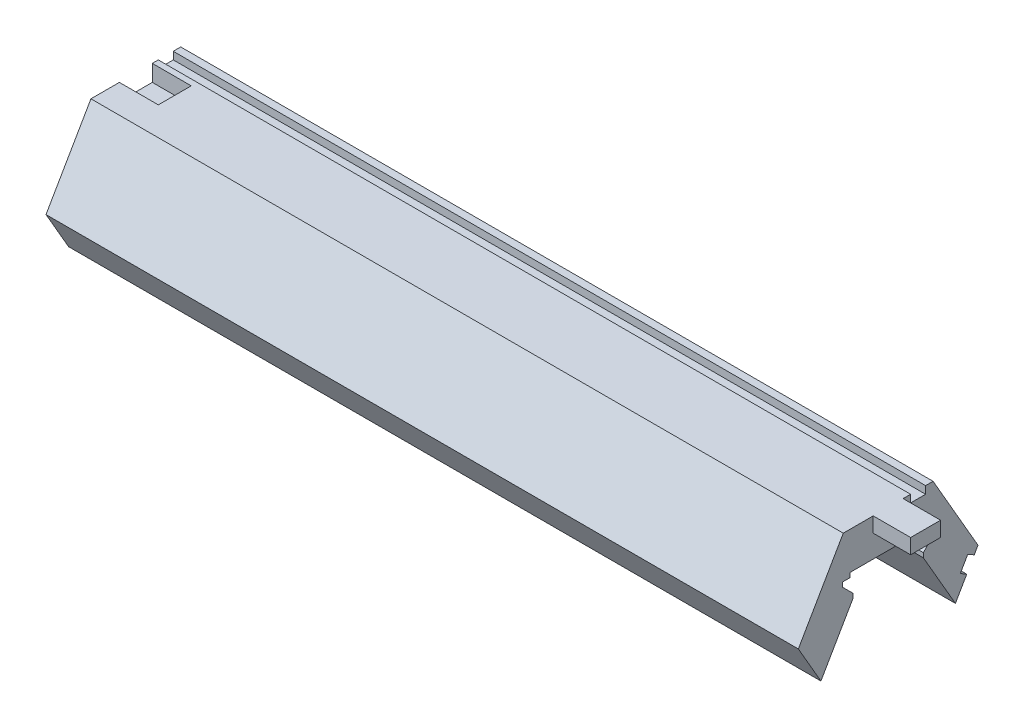
ISO-10303-21;
HEADER;
FILE_DESCRIPTION(('STEP AP214'),'2;1');
FILE_NAME('part.step','',(''),(''),'','','');
FILE_SCHEMA(('AUTOMOTIVE_DESIGN { 1 0 10303 214 1 1 1 1 }'));
ENDSEC;
DATA;
#1=APPLICATION_CONTEXT('core data for automotive mechanical design processes');
#2=APPLICATION_PROTOCOL_DEFINITION('international standard','automotive_design',2000,#1);
#3=PRODUCT_CONTEXT('',#1,'mechanical');
#4=PRODUCT('Part','Part','',(#3));
#5=PRODUCT_RELATED_PRODUCT_CATEGORY('part','',(#4));
#6=PRODUCT_DEFINITION_FORMATION('','',#4);
#7=PRODUCT_DEFINITION_CONTEXT('part definition',#1,'design');
#8=PRODUCT_DEFINITION('design','',#6,#7);
#9=PRODUCT_DEFINITION_SHAPE('','',#8);
#10=(LENGTH_UNIT() NAMED_UNIT(*) SI_UNIT(.MILLI.,.METRE.));
#11=(NAMED_UNIT(*) PLANE_ANGLE_UNIT() SI_UNIT($,.RADIAN.));
#12=(NAMED_UNIT(*) SI_UNIT($,.STERADIAN.) SOLID_ANGLE_UNIT());
#13=UNCERTAINTY_MEASURE_WITH_UNIT(LENGTH_MEASURE(1.E-05),#10,'distance_accuracy_value','');
#14=(GEOMETRIC_REPRESENTATION_CONTEXT(3) GLOBAL_UNCERTAINTY_ASSIGNED_CONTEXT((#13)) GLOBAL_UNIT_ASSIGNED_CONTEXT((#10,
#11,#12)) REPRESENTATION_CONTEXT('',''));
#15=CARTESIAN_POINT('',(0.,0.,0.));
#16=DIRECTION('',(0.,0.,1.));
#17=DIRECTION('',(1.,0.,0.));
#18=AXIS2_PLACEMENT_3D('',#15,#16,#17);
#19=CARTESIAN_POINT('',(50.25,0.,0.));
#20=DIRECTION('',(-1.,0.,0.));
#21=DIRECTION('',(0.,0.,1.));
#22=AXIS2_PLACEMENT_3D('',#19,#20,#21);
#23=PLANE('',#22);
#24=DIRECTION('',(0.,1.,0.));
#25=VECTOR('',#24,1.);
#26=CARTESIAN_POINT('',(50.25,10.3923048454133,-2.));
#27=LINE('',#26,#25);
#28=CARTESIAN_POINT('',(50.25,8.39230484541327,-2.));
#29=VERTEX_POINT('',#28);
#30=CARTESIAN_POINT('',(50.25,10.3923048454133,-2.));
#31=VERTEX_POINT('',#30);
#32=EDGE_CURVE('E56',#29,#31,#27,.T.);
#33=ORIENTED_EDGE('',*,*,#32,.F.);
#34=DIRECTION('',(0.,0.,-1.));
#35=VECTOR('',#34,1.);
#36=CARTESIAN_POINT('',(50.25,8.39230484541327,-2.));
#37=LINE('',#36,#35);
#38=CARTESIAN_POINT('',(50.25,8.39230484541326,2.));
#39=VERTEX_POINT('',#38);
#40=EDGE_CURVE('E287',#39,#29,#37,.T.);
#41=ORIENTED_EDGE('',*,*,#40,.F.);
#42=DIRECTION('',(0.,-1.,0.));
#43=VECTOR('',#42,1.);
#44=CARTESIAN_POINT('',(50.25,10.3923048454133,2.));
#45=LINE('',#44,#43);
#46=CARTESIAN_POINT('',(50.25,10.3923048454133,2.));
#47=VERTEX_POINT('',#46);
#48=EDGE_CURVE('E295',#47,#39,#45,.T.);
#49=ORIENTED_EDGE('',*,*,#48,.F.);
#50=DIRECTION('',(0.,0.,1.));
#51=VECTOR('',#50,1.);
#52=CARTESIAN_POINT('',(50.25,10.3923048454133,-6.));
#53=LINE('',#52,#51);
#54=CARTESIAN_POINT('',(50.25,10.3923048454133,6.));
#55=VERTEX_POINT('',#54);
#56=EDGE_CURVE('E374',#47,#55,#53,.T.);
#57=ORIENTED_EDGE('',*,*,#56,.T.);
#58=DIRECTION('',(0.,-0.866025403784439,0.5));
#59=VECTOR('',#58,1.);
#60=CARTESIAN_POINT('',(50.25,10.3923048454133,6.));
#61=LINE('',#60,#59);
#62=CARTESIAN_POINT('',(50.25,0.,12.));
#63=VERTEX_POINT('',#62);
#64=EDGE_CURVE('E378',#55,#63,#61,.T.);
#65=ORIENTED_EDGE('',*,*,#64,.T.);
#66=DIRECTION('',(0.,-0.866025403784439,-0.5));
#67=VECTOR('',#66,1.);
#68=CARTESIAN_POINT('',(50.25,0.,12.));
#69=LINE('',#68,#67);
#70=CARTESIAN_POINT('',(50.25,-5.22583302491977,8.98286389632253));
#71=VERTEX_POINT('',#70);
#72=EDGE_CURVE('E381',#63,#71,#69,.T.);
#73=ORIENTED_EDGE('',*,*,#72,.T.);
#74=DIRECTION('',(0.,0.866025403784438,-0.500000000000001));
#75=VECTOR('',#74,1.);
#76=CARTESIAN_POINT('',(50.25,2.19230484541326,4.69999999999999));
#77=LINE('',#76,#75);
#78=CARTESIAN_POINT('',(50.25,2.19230484541326,4.69999999999999));
#79=VERTEX_POINT('',#78);
#80=EDGE_CURVE('E383',#71,#79,#77,.T.);
#81=ORIENTED_EDGE('',*,*,#80,.T.);
#82=DIRECTION('',(0.,1.,0.));
#83=VECTOR('',#82,1.);
#84=CARTESIAN_POINT('',(50.25,2.79230484541326,4.69999999999999));
#85=LINE('',#84,#83);
#86=CARTESIAN_POINT('',(50.25,2.79230484541326,4.69999999999999));
#87=VERTEX_POINT('',#86);
#88=EDGE_CURVE('E385',#79,#87,#85,.T.);
#89=ORIENTED_EDGE('',*,*,#88,.T.);
#90=DIRECTION('',(0.,0.707106781186546,0.707106781186549));
#91=VECTOR('',#90,1.);
#92=CARTESIAN_POINT('',(50.25,4.19230484541326,6.1));
#93=LINE('',#92,#91);
#94=CARTESIAN_POINT('',(50.25,4.19230484541326,6.1));
#95=VERTEX_POINT('',#94);
#96=EDGE_CURVE('E387',#87,#95,#93,.T.);
#97=ORIENTED_EDGE('',*,*,#96,.T.);
#98=DIRECTION('',(0.,1.,0.));
#99=VECTOR('',#98,1.);
#100=CARTESIAN_POINT('',(50.25,4.79230484541326,6.1));
#101=LINE('',#100,#99);
#102=CARTESIAN_POINT('',(50.25,4.79230484541326,6.1));
#103=VERTEX_POINT('',#102);
#104=EDGE_CURVE('E389',#95,#103,#101,.T.);
#105=ORIENTED_EDGE('',*,*,#104,.T.);
#106=DIRECTION('',(0.,0.,-1.));
#107=VECTOR('',#106,1.);
#108=CARTESIAN_POINT('',(50.25,4.79230484541326,5.1));
#109=LINE('',#108,#107);
#110=CARTESIAN_POINT('',(50.25,4.79230484541326,5.1));
#111=VERTEX_POINT('',#110);
#112=EDGE_CURVE('E391',#103,#111,#109,.T.);
#113=ORIENTED_EDGE('',*,*,#112,.T.);
#114=DIRECTION('',(0.,1.,0.));
#115=VECTOR('',#114,1.);
#116=CARTESIAN_POINT('',(50.25,5.39230484541326,5.1));
#117=LINE('',#116,#115);
#118=CARTESIAN_POINT('',(50.25,5.39230484541326,5.1));
#119=VERTEX_POINT('',#118);
#120=EDGE_CURVE('E393',#111,#119,#117,.T.);
#121=ORIENTED_EDGE('',*,*,#120,.T.);
#122=DIRECTION('',(0.,0.,-1.));
#123=VECTOR('',#122,1.);
#124=CARTESIAN_POINT('',(50.25,5.39230484541326,5.1));
#125=LINE('',#124,#123);
#126=CARTESIAN_POINT('',(50.25,5.39230484541326,-5.1));
#127=VERTEX_POINT('',#126);
#128=EDGE_CURVE('E395',#119,#127,#125,.T.);
#129=ORIENTED_EDGE('',*,*,#128,.T.);
#130=DIRECTION('',(0.,-1.,0.));
#131=VECTOR('',#130,1.);
#132=CARTESIAN_POINT('',(50.25,5.39230484541326,-5.1));
#133=LINE('',#132,#131);
#134=CARTESIAN_POINT('',(50.25,4.79230484541326,-5.1));
#135=VERTEX_POINT('',#134);
#136=EDGE_CURVE('E397',#127,#135,#133,.T.);
#137=ORIENTED_EDGE('',*,*,#136,.T.);
#138=DIRECTION('',(0.,0.,-1.));
#139=VECTOR('',#138,1.);
#140=CARTESIAN_POINT('',(50.25,4.79230484541326,-5.1));
#141=LINE('',#140,#139);
#142=CARTESIAN_POINT('',(50.25,4.79230484541326,-6.1));
#143=VERTEX_POINT('',#142);
#144=EDGE_CURVE('E399',#135,#143,#141,.T.);
#145=ORIENTED_EDGE('',*,*,#144,.T.);
#146=DIRECTION('',(0.,-1.,0.));
#147=VECTOR('',#146,1.);
#148=CARTESIAN_POINT('',(50.25,4.79230484541326,-6.1));
#149=LINE('',#148,#147);
#150=CARTESIAN_POINT('',(50.25,4.19230484541326,-6.1));
#151=VERTEX_POINT('',#150);
#152=EDGE_CURVE('E401',#143,#151,#149,.T.);
#153=ORIENTED_EDGE('',*,*,#152,.T.);
#154=DIRECTION('',(0.,-0.707106781186546,0.707106781186549));
#155=VECTOR('',#154,1.);
#156=CARTESIAN_POINT('',(50.25,4.19230484541326,-6.1));
#157=LINE('',#156,#155);
#158=CARTESIAN_POINT('',(50.25,2.79230484541326,-4.69999999999999));
#159=VERTEX_POINT('',#158);
#160=EDGE_CURVE('E403',#151,#159,#157,.T.);
#161=ORIENTED_EDGE('',*,*,#160,.T.);
#162=DIRECTION('',(0.,-1.,0.));
#163=VECTOR('',#162,1.);
#164=CARTESIAN_POINT('',(50.25,2.79230484541326,-4.69999999999999));
#165=LINE('',#164,#163);
#166=CARTESIAN_POINT('',(50.25,2.19230484541326,-4.69999999999999));
#167=VERTEX_POINT('',#166);
#168=EDGE_CURVE('E405',#159,#167,#165,.T.);
#169=ORIENTED_EDGE('',*,*,#168,.T.);
#170=DIRECTION('',(0.,-0.866025403784438,-0.500000000000001));
#171=VECTOR('',#170,1.);
#172=CARTESIAN_POINT('',(50.25,2.19230484541326,-4.69999999999999));
#173=LINE('',#172,#171);
#174=CARTESIAN_POINT('',(50.25,-5.22583302491977,-8.98286389632253));
#175=VERTEX_POINT('',#174);
#176=EDGE_CURVE('E364',#167,#175,#173,.T.);
#177=ORIENTED_EDGE('',*,*,#176,.T.);
#178=DIRECTION('',(0.,0.866025403784439,-0.499999999999999));
#179=VECTOR('',#178,1.);
#180=CARTESIAN_POINT('',(50.25,-5.22583302491977,-8.98286389632253));
#181=LINE('',#180,#179);
#182=CARTESIAN_POINT('',(50.25,-2.59807621135331,-10.5));
#183=VERTEX_POINT('',#182);
#184=EDGE_CURVE('E369',#175,#183,#181,.T.);
#185=ORIENTED_EDGE('',*,*,#184,.T.);
#186=DIRECTION('',(0.,-0.499999999999999,-0.866025403784439));
#187=VECTOR('',#186,1.);
#188=CARTESIAN_POINT('',(50.25,-2.09807621135331,-9.63397459621556));
#189=LINE('',#188,#187);
#190=CARTESIAN_POINT('',(50.25,-2.09807621135331,-9.63397459621556));
#191=VERTEX_POINT('',#190);
#192=EDGE_CURVE('E311',#191,#183,#189,.T.);
#193=ORIENTED_EDGE('',*,*,#192,.F.);
#194=DIRECTION('',(0.,-0.866025403784438,0.5));
#195=VECTOR('',#194,1.);
#196=CARTESIAN_POINT('',(50.25,-0.36602540378443,-10.6339745962156));
#197=LINE('',#196,#195);
#198=CARTESIAN_POINT('',(50.25,-0.36602540378443,-10.6339745962156));
#199=VERTEX_POINT('',#198);
#200=EDGE_CURVE('E344',#199,#191,#197,.T.);
#201=ORIENTED_EDGE('',*,*,#200,.F.);
#202=DIRECTION('',(0.,0.500000000000001,0.866025403784438));
#203=VECTOR('',#202,1.);
#204=CARTESIAN_POINT('',(50.25,-0.866025403784431,-11.5));
#205=LINE('',#204,#203);
#206=CARTESIAN_POINT('',(50.25,-0.866025403784431,-11.5));
#207=VERTEX_POINT('',#206);
#208=EDGE_CURVE('E352',#207,#199,#205,.T.);
#209=ORIENTED_EDGE('',*,*,#208,.F.);
#210=CARTESIAN_POINT('',(50.25,0.,-12.));
#211=VERTEX_POINT('',#210);
#212=EDGE_CURVE('E367',#207,#211,#181,.T.);
#213=ORIENTED_EDGE('',*,*,#212,.T.);
#214=DIRECTION('',(0.,0.866025403784438,0.5));
#215=VECTOR('',#214,1.);
#216=CARTESIAN_POINT('',(50.25,0.,-12.));
#217=LINE('',#216,#215);
#218=CARTESIAN_POINT('',(50.25,10.3923048454133,-6.));
#219=VERTEX_POINT('',#218);
#220=EDGE_CURVE('E372',#211,#219,#217,.T.);
#221=ORIENTED_EDGE('',*,*,#220,.T.);
#222=CARTESIAN_POINT('',(50.25,10.3923048454133,-5.));
#223=VERTEX_POINT('',#222);
#224=EDGE_CURVE('E375',#219,#223,#53,.T.);
#225=ORIENTED_EDGE('',*,*,#224,.T.);
#226=DIRECTION('',(0.,1.,0.));
#227=VECTOR('',#226,1.);
#228=CARTESIAN_POINT('',(50.25,10.3923048454133,-5.));
#229=LINE('',#228,#227);
#230=CARTESIAN_POINT('',(50.25,9.39230484541326,-5.));
#231=VERTEX_POINT('',#230);
#232=EDGE_CURVE('E316',#231,#223,#229,.T.);
#233=ORIENTED_EDGE('',*,*,#232,.F.);
#234=DIRECTION('',(0.,0.,-1.));
#235=VECTOR('',#234,1.);
#236=CARTESIAN_POINT('',(50.25,9.39230484541326,-5.));
#237=LINE('',#236,#235);
#238=CARTESIAN_POINT('',(50.25,9.39230484541326,-3.));
#239=VERTEX_POINT('',#238);
#240=EDGE_CURVE('E326',#239,#231,#237,.T.);
#241=ORIENTED_EDGE('',*,*,#240,.F.);
#242=DIRECTION('',(0.,-1.,0.));
#243=VECTOR('',#242,1.);
#244=CARTESIAN_POINT('',(50.25,9.39230484541326,-3.));
#245=LINE('',#244,#243);
#246=CARTESIAN_POINT('',(50.25,10.3923048454133,-3.));
#247=VERTEX_POINT('',#246);
#248=EDGE_CURVE('E323',#247,#239,#245,.T.);
#249=ORIENTED_EDGE('',*,*,#248,.F.);
#250=EDGE_CURVE('E379',#247,#31,#53,.T.);
#251=ORIENTED_EDGE('',*,*,#250,.T.);
#252=EDGE_LOOP('',(#33,#41,#49,#57,#65,#73,#81,#89,#97,#105,#113,#121,#129,#137,#145,#153,#161,
#169,#177,#185,#193,#201,#209,#213,#221,#225,#233,#241,#249,#251));
#253=FACE_BOUND('',#252,.T.);
#254=ADVANCED_FACE('F33',(#253),#23,.F.);
#255=CARTESIAN_POINT('',(50.25,-5.22583302491977,-8.98286389632253));
#256=DIRECTION('',(0.,0.499999999999999,0.866025403784439));
#257=DIRECTION('',(0.,-0.866025403784439,0.499999999999999));
#258=AXIS2_PLACEMENT_3D('',#255,#256,#257);
#259=PLANE('',#258);
#260=DIRECTION('',(0.,0.866025403784439,-0.499999999999999));
#261=VECTOR('',#260,1.);
#262=CARTESIAN_POINT('',(-50.25,-5.22583302491977,-8.98286389632253));
#263=LINE('',#262,#261);
#264=CARTESIAN_POINT('',(-50.25,-5.22583302491977,-8.98286389632253));
#265=VERTEX_POINT('',#264);
#266=CARTESIAN_POINT('',(-50.25,-2.59807621135331,-10.5));
#267=VERTEX_POINT('',#266);
#268=EDGE_CURVE('E411',#265,#267,#263,.T.);
#269=ORIENTED_EDGE('',*,*,#268,.T.);
#270=DIRECTION('',(1.,0.,0.));
#271=VECTOR('',#270,1.);
#272=CARTESIAN_POINT('',(-50.25,-2.59807621135331,-10.5));
#273=LINE('',#272,#271);
#274=EDGE_CURVE('E350',#267,#183,#273,.T.);
#275=ORIENTED_EDGE('',*,*,#274,.T.);
#276=ORIENTED_EDGE('',*,*,#184,.F.);
#277=DIRECTION('',(-1.,0.,0.));
#278=VECTOR('',#277,1.);
#279=CARTESIAN_POINT('',(50.25,-5.22583302491977,-8.98286389632253));
#280=LINE('',#279,#278);
#281=EDGE_CURVE('E11',#175,#265,#280,.T.);
#282=ORIENTED_EDGE('',*,*,#281,.T.);
#283=EDGE_LOOP('',(#269,#275,#276,#282));
#284=FACE_BOUND('',#283,.T.);
#285=ADVANCED_FACE('F527',(#284),#259,.F.);
#286=CARTESIAN_POINT('',(50.25,10.3923048454133,-6.));
#287=DIRECTION('',(0.,-1.,0.));
#288=DIRECTION('',(0.,0.,-1.));
#289=AXIS2_PLACEMENT_3D('',#286,#287,#288);
#290=PLANE('',#289);
#291=DIRECTION('',(0.,0.,1.));
#292=VECTOR('',#291,1.);
#293=CARTESIAN_POINT('',(-50.25,10.3923048454133,-6.));
#294=LINE('',#293,#292);
#295=CARTESIAN_POINT('',(-50.25,10.3923048454133,-6.));
#296=VERTEX_POINT('',#295);
#297=CARTESIAN_POINT('',(-50.25,10.3923048454133,-5.));
#298=VERTEX_POINT('',#297);
#299=EDGE_CURVE('E417',#296,#298,#294,.T.);
#300=ORIENTED_EDGE('',*,*,#299,.T.);
#301=DIRECTION('',(1.,0.,0.));
#302=VECTOR('',#301,1.);
#303=CARTESIAN_POINT('',(-50.25,10.3923048454133,-5.));
#304=LINE('',#303,#302);
#305=EDGE_CURVE('E331',#298,#223,#304,.T.);
#306=ORIENTED_EDGE('',*,*,#305,.T.);
#307=ORIENTED_EDGE('',*,*,#224,.F.);
#308=DIRECTION('',(-1.,0.,0.));
#309=VECTOR('',#308,1.);
#310=CARTESIAN_POINT('',(50.25,10.3923048454133,-6.));
#311=LINE('',#310,#309);
#312=EDGE_CURVE('E491',#219,#296,#311,.T.);
#313=ORIENTED_EDGE('',*,*,#312,.T.);
#314=EDGE_LOOP('',(#300,#306,#307,#313));
#315=FACE_BOUND('',#314,.T.);
#316=ADVANCED_FACE('F509',(#315),#290,.F.);
#317=CARTESIAN_POINT('',(50.25,2.19230484541326,-4.69999999999999));
#318=DIRECTION('',(0.,0.500000000000001,-0.866025403784438));
#319=DIRECTION('',(0.,0.866025403784438,0.500000000000001));
#320=AXIS2_PLACEMENT_3D('',#317,#318,#319);
#321=PLANE('',#320);
#322=DIRECTION('',(0.,-0.866025403784438,-0.500000000000001));
#323=VECTOR('',#322,1.);
#324=CARTESIAN_POINT('',(-50.25,2.19230484541326,-4.69999999999999));
#325=LINE('',#324,#323);
#326=CARTESIAN_POINT('',(-50.25,2.19230484541326,-4.69999999999999));
#327=VERTEX_POINT('',#326);
#328=EDGE_CURVE('E334',#327,#265,#325,.T.);
#329=ORIENTED_EDGE('',*,*,#328,.T.);
#330=ORIENTED_EDGE('',*,*,#281,.F.);
#331=ORIENTED_EDGE('',*,*,#176,.F.);
#332=DIRECTION('',(-1.,0.,0.));
#333=VECTOR('',#332,1.);
#334=CARTESIAN_POINT('',(50.25,2.19230484541326,-4.69999999999999));
#335=LINE('',#334,#333);
#336=EDGE_CURVE('E407',#167,#327,#335,.T.);
#337=ORIENTED_EDGE('',*,*,#336,.T.);
#338=EDGE_LOOP('',(#329,#330,#331,#337));
#339=FACE_BOUND('',#338,.T.);
#340=ADVANCED_FACE('F35',(#339),#321,.F.);
#341=ORIENTED_EDGE('',*,*,#212,.F.);
#342=DIRECTION('',(1.,0.,0.));
#343=VECTOR('',#342,1.);
#344=CARTESIAN_POINT('',(-50.25,-0.866025403784431,-11.5));
#345=LINE('',#344,#343);
#346=CARTESIAN_POINT('',(-50.25,-0.866025403784431,-11.5));
#347=VERTEX_POINT('',#346);
#348=EDGE_CURVE('E360',#347,#207,#345,.T.);
#349=ORIENTED_EDGE('',*,*,#348,.F.);
#350=CARTESIAN_POINT('',(-50.25,0.,-12.));
#351=VERTEX_POINT('',#350);
#352=EDGE_CURVE('E410',#347,#351,#263,.T.);
#353=ORIENTED_EDGE('',*,*,#352,.T.);
#354=DIRECTION('',(-1.,0.,0.));
#355=VECTOR('',#354,1.);
#356=CARTESIAN_POINT('',(50.25,0.,-12.));
#357=LINE('',#356,#355);
#358=EDGE_CURVE('E41',#211,#351,#357,.T.);
#359=ORIENTED_EDGE('',*,*,#358,.F.);
#360=EDGE_LOOP('',(#341,#349,#353,#359));
#361=FACE_BOUND('',#360,.T.);
#362=ADVANCED_FACE('F516',(#361),#259,.F.);
#363=CARTESIAN_POINT('',(50.25,0.,-12.));
#364=DIRECTION('',(0.,-0.5,0.866025403784438));
#365=DIRECTION('',(0.,-0.866025403784439,-0.5));
#366=AXIS2_PLACEMENT_3D('',#363,#364,#365);
#367=PLANE('',#366);
#368=DIRECTION('',(0.,0.866025403784438,0.5));
#369=VECTOR('',#368,1.);
#370=CARTESIAN_POINT('',(-50.25,0.,-12.));
#371=LINE('',#370,#369);
#372=EDGE_CURVE('E414',#351,#296,#371,.T.);
#373=ORIENTED_EDGE('',*,*,#372,.T.);
#374=ORIENTED_EDGE('',*,*,#312,.F.);
#375=ORIENTED_EDGE('',*,*,#220,.F.);
#376=ORIENTED_EDGE('',*,*,#358,.T.);
#377=EDGE_LOOP('',(#373,#374,#375,#376));
#378=FACE_BOUND('',#377,.T.);
#379=ADVANCED_FACE('F498',(#378),#367,.F.);
#380=DIRECTION('',(0.,0.,-1.));
#381=VECTOR('',#380,1.);
#382=CARTESIAN_POINT('',(-45.05,10.3923048454133,-2.));
#383=LINE('',#382,#381);
#384=CARTESIAN_POINT('',(-45.05,10.3923048454133,2.2));
#385=VERTEX_POINT('',#384);
#386=CARTESIAN_POINT('',(-45.05,10.3923048454133,-2.2));
#387=VERTEX_POINT('',#386);
#388=EDGE_CURVE('E261',#385,#387,#383,.T.);
#389=ORIENTED_EDGE('',*,*,#388,.F.);
#390=DIRECTION('',(-1.,0.,0.));
#391=VECTOR('',#390,1.);
#392=CARTESIAN_POINT('',(-45.05,10.3923048454133,2.2));
#393=LINE('',#392,#391);
#394=CARTESIAN_POINT('',(-50.25,10.3923048454133,2.2));
#395=VERTEX_POINT('',#394);
#396=EDGE_CURVE('E296',#385,#395,#393,.T.);
#397=ORIENTED_EDGE('',*,*,#396,.T.);
#398=CARTESIAN_POINT('',(-50.25,10.3923048454133,6.));
#399=VERTEX_POINT('',#398);
#400=EDGE_CURVE('E416',#395,#399,#294,.T.);
#401=ORIENTED_EDGE('',*,*,#400,.T.);
#402=DIRECTION('',(-1.,0.,0.));
#403=VECTOR('',#402,1.);
#404=CARTESIAN_POINT('',(50.25,10.3923048454133,6.));
#405=LINE('',#404,#403);
#406=EDGE_CURVE('E488',#55,#399,#405,.T.);
#407=ORIENTED_EDGE('',*,*,#406,.F.);
#408=ORIENTED_EDGE('',*,*,#56,.F.);
#409=DIRECTION('',(-1.,0.,0.));
#410=VECTOR('',#409,1.);
#411=CARTESIAN_POINT('',(55.25,10.3923048454133,2.));
#412=LINE('',#411,#410);
#413=CARTESIAN_POINT('',(55.25,10.3923048454133,2.));
#414=VERTEX_POINT('',#413);
#415=EDGE_CURVE('E305',#414,#47,#412,.T.);
#416=ORIENTED_EDGE('',*,*,#415,.F.);
#417=DIRECTION('',(0.,0.,1.));
#418=VECTOR('',#417,1.);
#419=CARTESIAN_POINT('',(55.25,10.3923048454133,-2.));
#420=LINE('',#419,#418);
#421=CARTESIAN_POINT('',(55.25,10.3923048454133,-2.));
#422=VERTEX_POINT('',#421);
#423=EDGE_CURVE('E286',#422,#414,#420,.T.);
#424=ORIENTED_EDGE('',*,*,#423,.F.);
#425=DIRECTION('',(-1.,0.,0.));
#426=VECTOR('',#425,1.);
#427=CARTESIAN_POINT('',(55.25,10.3923048454133,-2.));
#428=LINE('',#427,#426);
#429=EDGE_CURVE('E308',#422,#31,#428,.T.);
#430=ORIENTED_EDGE('',*,*,#429,.T.);
#431=ORIENTED_EDGE('',*,*,#250,.F.);
#432=DIRECTION('',(1.,0.,0.));
#433=VECTOR('',#432,1.);
#434=CARTESIAN_POINT('',(-50.25,10.3923048454133,-3.));
#435=LINE('',#434,#433);
#436=CARTESIAN_POINT('',(-50.25,10.3923048454133,-3.));
#437=VERTEX_POINT('',#436);
#438=EDGE_CURVE('E322',#437,#247,#435,.T.);
#439=ORIENTED_EDGE('',*,*,#438,.F.);
#440=CARTESIAN_POINT('',(-50.25,10.3923048454133,-2.2));
#441=VERTEX_POINT('',#440);
#442=EDGE_CURVE('E276',#437,#441,#294,.T.);
#443=ORIENTED_EDGE('',*,*,#442,.T.);
#444=DIRECTION('',(-1.,0.,0.));
#445=VECTOR('',#444,1.);
#446=CARTESIAN_POINT('',(-45.05,10.3923048454133,-2.2));
#447=LINE('',#446,#445);
#448=EDGE_CURVE('E48',#387,#441,#447,.T.);
#449=ORIENTED_EDGE('',*,*,#448,.F.);
#450=EDGE_LOOP('',(#389,#397,#401,#407,#408,#416,#424,#430,#431,#439,#443,#449));
#451=FACE_BOUND('',#450,.T.);
#452=ADVANCED_FACE('F273',(#451),#290,.F.);
#453=CARTESIAN_POINT('',(50.25,10.3923048454133,6.));
#454=DIRECTION('',(0.,-0.5,-0.866025403784439));
#455=DIRECTION('',(0.,0.866025403784439,-0.5));
#456=AXIS2_PLACEMENT_3D('',#453,#454,#455);
#457=PLANE('',#456);
#458=DIRECTION('',(0.,-0.866025403784439,0.5));
#459=VECTOR('',#458,1.);
#460=CARTESIAN_POINT('',(-50.25,10.3923048454133,6.));
#461=LINE('',#460,#459);
#462=CARTESIAN_POINT('',(-50.25,0.,12.));
#463=VERTEX_POINT('',#462);
#464=EDGE_CURVE('E420',#399,#463,#461,.T.);
#465=ORIENTED_EDGE('',*,*,#464,.T.);
#466=DIRECTION('',(-1.,0.,0.));
#467=VECTOR('',#466,1.);
#468=CARTESIAN_POINT('',(50.25,0.,12.));
#469=LINE('',#468,#467);
#470=EDGE_CURVE('E485',#63,#463,#469,.T.);
#471=ORIENTED_EDGE('',*,*,#470,.F.);
#472=ORIENTED_EDGE('',*,*,#64,.F.);
#473=ORIENTED_EDGE('',*,*,#406,.T.);
#474=EDGE_LOOP('',(#465,#471,#472,#473));
#475=FACE_BOUND('',#474,.T.);
#476=ADVANCED_FACE('F602',(#475),#457,.F.);
#477=CARTESIAN_POINT('',(50.25,0.,12.));
#478=DIRECTION('',(0.,0.5,-0.866025403784439));
#479=DIRECTION('',(0.,0.866025403784439,0.5));
#480=AXIS2_PLACEMENT_3D('',#477,#478,#479);
#481=PLANE('',#480);
#482=DIRECTION('',(0.,-0.866025403784439,-0.5));
#483=VECTOR('',#482,1.);
#484=CARTESIAN_POINT('',(-50.25,0.,12.));
#485=LINE('',#484,#483);
#486=CARTESIAN_POINT('',(-50.25,-5.22583302491977,8.98286389632253));
#487=VERTEX_POINT('',#486);
#488=EDGE_CURVE('E422',#463,#487,#485,.T.);
#489=ORIENTED_EDGE('',*,*,#488,.T.);
#490=DIRECTION('',(-1.,0.,0.));
#491=VECTOR('',#490,1.);
#492=CARTESIAN_POINT('',(50.25,-5.22583302491977,8.98286389632253));
#493=LINE('',#492,#491);
#494=EDGE_CURVE('E482',#71,#487,#493,.T.);
#495=ORIENTED_EDGE('',*,*,#494,.F.);
#496=ORIENTED_EDGE('',*,*,#72,.F.);
#497=ORIENTED_EDGE('',*,*,#470,.T.);
#498=EDGE_LOOP('',(#489,#495,#496,#497));
#499=FACE_BOUND('',#498,.T.);
#500=ADVANCED_FACE('F597',(#499),#481,.F.);
#501=CARTESIAN_POINT('',(50.25,2.19230484541326,4.69999999999999));
#502=DIRECTION('',(0.,0.500000000000001,0.866025403784438));
#503=DIRECTION('',(0.,-0.866025403784438,0.500000000000001));
#504=AXIS2_PLACEMENT_3D('',#501,#502,#503);
#505=PLANE('',#504);
#506=DIRECTION('',(0.,0.866025403784438,-0.500000000000001));
#507=VECTOR('',#506,1.);
#508=CARTESIAN_POINT('',(-50.25,2.19230484541326,4.69999999999999));
#509=LINE('',#508,#507);
#510=CARTESIAN_POINT('',(-50.25,2.19230484541326,4.69999999999999));
#511=VERTEX_POINT('',#510);
#512=EDGE_CURVE('E424',#487,#511,#509,.T.);
#513=ORIENTED_EDGE('',*,*,#512,.T.);
#514=DIRECTION('',(-1.,0.,0.));
#515=VECTOR('',#514,1.);
#516=CARTESIAN_POINT('',(50.25,2.19230484541326,4.69999999999999));
#517=LINE('',#516,#515);
#518=EDGE_CURVE('E479',#79,#511,#517,.T.);
#519=ORIENTED_EDGE('',*,*,#518,.F.);
#520=ORIENTED_EDGE('',*,*,#80,.F.);
#521=ORIENTED_EDGE('',*,*,#494,.T.);
#522=EDGE_LOOP('',(#513,#519,#520,#521));
#523=FACE_BOUND('',#522,.T.);
#524=ADVANCED_FACE('F591',(#523),#505,.F.);
#525=CARTESIAN_POINT('',(50.25,2.79230484541326,4.69999999999999));
#526=DIRECTION('',(0.,0.,1.));
#527=DIRECTION('',(0.,-1.,0.));
#528=AXIS2_PLACEMENT_3D('',#525,#526,#527);
#529=PLANE('',#528);
#530=DIRECTION('',(0.,1.,0.));
#531=VECTOR('',#530,1.);
#532=CARTESIAN_POINT('',(-50.25,2.79230484541326,4.69999999999999));
#533=LINE('',#532,#531);
#534=CARTESIAN_POINT('',(-50.25,2.79230484541326,4.69999999999999));
#535=VERTEX_POINT('',#534);
#536=EDGE_CURVE('E426',#511,#535,#533,.T.);
#537=ORIENTED_EDGE('',*,*,#536,.T.);
#538=DIRECTION('',(-1.,0.,0.));
#539=VECTOR('',#538,1.);
#540=CARTESIAN_POINT('',(50.25,2.79230484541326,4.69999999999999));
#541=LINE('',#540,#539);
#542=EDGE_CURVE('E476',#87,#535,#541,.T.);
#543=ORIENTED_EDGE('',*,*,#542,.F.);
#544=ORIENTED_EDGE('',*,*,#88,.F.);
#545=ORIENTED_EDGE('',*,*,#518,.T.);
#546=EDGE_LOOP('',(#537,#543,#544,#545));
#547=FACE_BOUND('',#546,.T.);
#548=ADVANCED_FACE('F587',(#547),#529,.F.);
#549=CARTESIAN_POINT('',(50.25,4.19230484541326,6.1));
#550=DIRECTION('',(0.,-0.707106781186549,0.707106781186546));
#551=DIRECTION('',(0.,-0.707106781186546,-0.707106781186549));
#552=AXIS2_PLACEMENT_3D('',#549,#550,#551);
#553=PLANE('',#552);
#554=DIRECTION('',(0.,0.707106781186546,0.707106781186549));
#555=VECTOR('',#554,1.);
#556=CARTESIAN_POINT('',(-50.25,4.19230484541326,6.1));
#557=LINE('',#556,#555);
#558=CARTESIAN_POINT('',(-50.25,4.19230484541326,6.1));
#559=VERTEX_POINT('',#558);
#560=EDGE_CURVE('E428',#535,#559,#557,.T.);
#561=ORIENTED_EDGE('',*,*,#560,.T.);
#562=DIRECTION('',(-1.,0.,0.));
#563=VECTOR('',#562,1.);
#564=CARTESIAN_POINT('',(50.25,4.19230484541326,6.1));
#565=LINE('',#564,#563);
#566=EDGE_CURVE('E473',#95,#559,#565,.T.);
#567=ORIENTED_EDGE('',*,*,#566,.F.);
#568=ORIENTED_EDGE('',*,*,#96,.F.);
#569=ORIENTED_EDGE('',*,*,#542,.T.);
#570=EDGE_LOOP('',(#561,#567,#568,#569));
#571=FACE_BOUND('',#570,.T.);
#572=ADVANCED_FACE('F582',(#571),#553,.F.);
#573=CARTESIAN_POINT('',(50.25,4.79230484541326,6.1));
#574=DIRECTION('',(0.,0.,1.));
#575=DIRECTION('',(1.,0.,0.));
#576=AXIS2_PLACEMENT_3D('',#573,#574,#575);
#577=PLANE('',#576);
#578=DIRECTION('',(0.,1.,0.));
#579=VECTOR('',#578,1.);
#580=CARTESIAN_POINT('',(-50.25,4.79230484541326,6.1));
#581=LINE('',#580,#579);
#582=CARTESIAN_POINT('',(-50.25,4.79230484541326,6.1));
#583=VERTEX_POINT('',#582);
#584=EDGE_CURVE('E430',#559,#583,#581,.T.);
#585=ORIENTED_EDGE('',*,*,#584,.T.);
#586=DIRECTION('',(-1.,0.,0.));
#587=VECTOR('',#586,1.);
#588=CARTESIAN_POINT('',(50.25,4.79230484541326,6.1));
#589=LINE('',#588,#587);
#590=EDGE_CURVE('E470',#103,#583,#589,.T.);
#591=ORIENTED_EDGE('',*,*,#590,.F.);
#592=ORIENTED_EDGE('',*,*,#104,.F.);
#593=ORIENTED_EDGE('',*,*,#566,.T.);
#594=EDGE_LOOP('',(#585,#591,#592,#593));
#595=FACE_BOUND('',#594,.T.);
#596=ADVANCED_FACE('F576',(#595),#577,.F.);
#597=CARTESIAN_POINT('',(50.25,4.79230484541326,5.1));
#598=DIRECTION('',(0.,1.,0.));
#599=DIRECTION('',(0.,0.,1.));
#600=AXIS2_PLACEMENT_3D('',#597,#598,#599);
#601=PLANE('',#600);
#602=DIRECTION('',(0.,0.,-1.));
#603=VECTOR('',#602,1.);
#604=CARTESIAN_POINT('',(-50.25,4.79230484541326,5.1));
#605=LINE('',#604,#603);
#606=CARTESIAN_POINT('',(-50.25,4.79230484541326,5.1));
#607=VERTEX_POINT('',#606);
#608=EDGE_CURVE('E432',#583,#607,#605,.T.);
#609=ORIENTED_EDGE('',*,*,#608,.T.);
#610=DIRECTION('',(-1.,0.,0.));
#611=VECTOR('',#610,1.);
#612=CARTESIAN_POINT('',(50.25,4.79230484541326,5.1));
#613=LINE('',#612,#611);
#614=EDGE_CURVE('E467',#111,#607,#613,.T.);
#615=ORIENTED_EDGE('',*,*,#614,.F.);
#616=ORIENTED_EDGE('',*,*,#112,.F.);
#617=ORIENTED_EDGE('',*,*,#590,.T.);
#618=EDGE_LOOP('',(#609,#615,#616,#617));
#619=FACE_BOUND('',#618,.T.);
#620=ADVANCED_FACE('F572',(#619),#601,.F.);
#621=CARTESIAN_POINT('',(50.25,5.39230484541326,5.1));
#622=DIRECTION('',(0.,0.,1.));
#623=DIRECTION('',(1.,0.,0.));
#624=AXIS2_PLACEMENT_3D('',#621,#622,#623);
#625=PLANE('',#624);
#626=DIRECTION('',(0.,1.,0.));
#627=VECTOR('',#626,1.);
#628=CARTESIAN_POINT('',(-50.25,5.39230484541326,5.1));
#629=LINE('',#628,#627);
#630=CARTESIAN_POINT('',(-50.25,5.39230484541326,5.1));
#631=VERTEX_POINT('',#630);
#632=EDGE_CURVE('E434',#607,#631,#629,.T.);
#633=ORIENTED_EDGE('',*,*,#632,.T.);
#634=DIRECTION('',(-1.,0.,0.));
#635=VECTOR('',#634,1.);
#636=CARTESIAN_POINT('',(50.25,5.39230484541326,5.1));
#637=LINE('',#636,#635);
#638=EDGE_CURVE('E464',#119,#631,#637,.T.);
#639=ORIENTED_EDGE('',*,*,#638,.F.);
#640=ORIENTED_EDGE('',*,*,#120,.F.);
#641=ORIENTED_EDGE('',*,*,#614,.T.);
#642=EDGE_LOOP('',(#633,#639,#640,#641));
#643=FACE_BOUND('',#642,.T.);
#644=ADVANCED_FACE('F567',(#643),#625,.F.);
#645=CARTESIAN_POINT('',(50.25,5.39230484541326,5.1));
#646=DIRECTION('',(0.,1.,0.));
#647=DIRECTION('',(0.,0.,1.));
#648=AXIS2_PLACEMENT_3D('',#645,#646,#647);
#649=PLANE('',#648);
#650=DIRECTION('',(0.,0.,-1.));
#651=VECTOR('',#650,1.);
#652=CARTESIAN_POINT('',(-50.25,5.39230484541326,5.1));
#653=LINE('',#652,#651);
#654=CARTESIAN_POINT('',(-50.25,5.39230484541326,-5.1));
#655=VERTEX_POINT('',#654);
#656=EDGE_CURVE('E436',#631,#655,#653,.T.);
#657=ORIENTED_EDGE('',*,*,#656,.T.);
#658=DIRECTION('',(-1.,0.,0.));
#659=VECTOR('',#658,1.);
#660=CARTESIAN_POINT('',(50.25,5.39230484541326,-5.1));
#661=LINE('',#660,#659);
#662=EDGE_CURVE('E461',#127,#655,#661,.T.);
#663=ORIENTED_EDGE('',*,*,#662,.F.);
#664=ORIENTED_EDGE('',*,*,#128,.F.);
#665=ORIENTED_EDGE('',*,*,#638,.T.);
#666=EDGE_LOOP('',(#657,#663,#664,#665));
#667=FACE_BOUND('',#666,.T.);
#668=ADVANCED_FACE('F561',(#667),#649,.F.);
#669=CARTESIAN_POINT('',(50.25,5.39230484541326,-5.1));
#670=DIRECTION('',(0.,0.,-1.));
#671=DIRECTION('',(-1.,0.,0.));
#672=AXIS2_PLACEMENT_3D('',#669,#670,#671);
#673=PLANE('',#672);
#674=DIRECTION('',(0.,-1.,0.));
#675=VECTOR('',#674,1.);
#676=CARTESIAN_POINT('',(-50.25,5.39230484541326,-5.1));
#677=LINE('',#676,#675);
#678=CARTESIAN_POINT('',(-50.25,4.79230484541326,-5.1));
#679=VERTEX_POINT('',#678);
#680=EDGE_CURVE('E438',#655,#679,#677,.T.);
#681=ORIENTED_EDGE('',*,*,#680,.T.);
#682=DIRECTION('',(-1.,0.,0.));
#683=VECTOR('',#682,1.);
#684=CARTESIAN_POINT('',(50.25,4.79230484541326,-5.1));
#685=LINE('',#684,#683);
#686=EDGE_CURVE('E458',#135,#679,#685,.T.);
#687=ORIENTED_EDGE('',*,*,#686,.F.);
#688=ORIENTED_EDGE('',*,*,#136,.F.);
#689=ORIENTED_EDGE('',*,*,#662,.T.);
#690=EDGE_LOOP('',(#681,#687,#688,#689));
#691=FACE_BOUND('',#690,.T.);
#692=ADVANCED_FACE('F557',(#691),#673,.F.);
#693=CARTESIAN_POINT('',(50.25,4.79230484541326,-5.1));
#694=DIRECTION('',(0.,1.,0.));
#695=DIRECTION('',(0.,0.,1.));
#696=AXIS2_PLACEMENT_3D('',#693,#694,#695);
#697=PLANE('',#696);
#698=DIRECTION('',(0.,0.,-1.));
#699=VECTOR('',#698,1.);
#700=CARTESIAN_POINT('',(-50.25,4.79230484541326,-5.1));
#701=LINE('',#700,#699);
#702=CARTESIAN_POINT('',(-50.25,4.79230484541326,-6.1));
#703=VERTEX_POINT('',#702);
#704=EDGE_CURVE('E440',#679,#703,#701,.T.);
#705=ORIENTED_EDGE('',*,*,#704,.T.);
#706=DIRECTION('',(-1.,0.,0.));
#707=VECTOR('',#706,1.);
#708=CARTESIAN_POINT('',(50.25,4.79230484541326,-6.1));
#709=LINE('',#708,#707);
#710=EDGE_CURVE('E455',#143,#703,#709,.T.);
#711=ORIENTED_EDGE('',*,*,#710,.F.);
#712=ORIENTED_EDGE('',*,*,#144,.F.);
#713=ORIENTED_EDGE('',*,*,#686,.T.);
#714=EDGE_LOOP('',(#705,#711,#712,#713));
#715=FACE_BOUND('',#714,.T.);
#716=ADVANCED_FACE('F552',(#715),#697,.F.);
#717=CARTESIAN_POINT('',(50.25,4.79230484541326,-6.1));
#718=DIRECTION('',(0.,0.,-1.));
#719=DIRECTION('',(-1.,0.,0.));
#720=AXIS2_PLACEMENT_3D('',#717,#718,#719);
#721=PLANE('',#720);
#722=DIRECTION('',(0.,-1.,0.));
#723=VECTOR('',#722,1.);
#724=CARTESIAN_POINT('',(-50.25,4.79230484541326,-6.1));
#725=LINE('',#724,#723);
#726=CARTESIAN_POINT('',(-50.25,4.19230484541326,-6.1));
#727=VERTEX_POINT('',#726);
#728=EDGE_CURVE('E442',#703,#727,#725,.T.);
#729=ORIENTED_EDGE('',*,*,#728,.T.);
#730=DIRECTION('',(-1.,0.,0.));
#731=VECTOR('',#730,1.);
#732=CARTESIAN_POINT('',(50.25,4.19230484541326,-6.1));
#733=LINE('',#732,#731);
#734=EDGE_CURVE('E452',#151,#727,#733,.T.);
#735=ORIENTED_EDGE('',*,*,#734,.F.);
#736=ORIENTED_EDGE('',*,*,#152,.F.);
#737=ORIENTED_EDGE('',*,*,#710,.T.);
#738=EDGE_LOOP('',(#729,#735,#736,#737));
#739=FACE_BOUND('',#738,.T.);
#740=ADVANCED_FACE('F546',(#739),#721,.F.);
#741=CARTESIAN_POINT('',(50.25,4.19230484541326,-6.1));
#742=DIRECTION('',(0.,-0.707106781186549,-0.707106781186546));
#743=DIRECTION('',(0.,0.707106781186546,-0.707106781186549));
#744=AXIS2_PLACEMENT_3D('',#741,#742,#743);
#745=PLANE('',#744);
#746=DIRECTION('',(0.,-0.707106781186546,0.707106781186549));
#747=VECTOR('',#746,1.);
#748=CARTESIAN_POINT('',(-50.25,4.19230484541326,-6.1));
#749=LINE('',#748,#747);
#750=CARTESIAN_POINT('',(-50.25,2.79230484541326,-4.69999999999999));
#751=VERTEX_POINT('',#750);
#752=EDGE_CURVE('E444',#727,#751,#749,.T.);
#753=ORIENTED_EDGE('',*,*,#752,.T.);
#754=DIRECTION('',(-1.,0.,0.));
#755=VECTOR('',#754,1.);
#756=CARTESIAN_POINT('',(50.25,2.79230484541326,-4.69999999999999));
#757=LINE('',#756,#755);
#758=EDGE_CURVE('E449',#159,#751,#757,.T.);
#759=ORIENTED_EDGE('',*,*,#758,.F.);
#760=ORIENTED_EDGE('',*,*,#160,.F.);
#761=ORIENTED_EDGE('',*,*,#734,.T.);
#762=EDGE_LOOP('',(#753,#759,#760,#761));
#763=FACE_BOUND('',#762,.T.);
#764=ADVANCED_FACE('F542',(#763),#745,.F.);
#765=CARTESIAN_POINT('',(50.25,2.79230484541326,-4.69999999999999));
#766=DIRECTION('',(0.,0.,-1.));
#767=DIRECTION('',(0.,1.,0.));
#768=AXIS2_PLACEMENT_3D('',#765,#766,#767);
#769=PLANE('',#768);
#770=DIRECTION('',(0.,-1.,0.));
#771=VECTOR('',#770,1.);
#772=CARTESIAN_POINT('',(-50.25,2.79230484541326,-4.69999999999999));
#773=LINE('',#772,#771);
#774=EDGE_CURVE('E368',#751,#327,#773,.T.);
#775=ORIENTED_EDGE('',*,*,#774,.T.);
#776=ORIENTED_EDGE('',*,*,#336,.F.);
#777=ORIENTED_EDGE('',*,*,#168,.F.);
#778=ORIENTED_EDGE('',*,*,#758,.T.);
#779=EDGE_LOOP('',(#775,#776,#777,#778));
#780=FACE_BOUND('',#779,.T.);
#781=ADVANCED_FACE('F538',(#780),#769,.F.);
#782=CARTESIAN_POINT('',(-50.25,0.,0.));
#783=DIRECTION('',(-1.,0.,0.));
#784=DIRECTION('',(0.,0.,1.));
#785=AXIS2_PLACEMENT_3D('',#782,#783,#784);
#786=PLANE('',#785);
#787=DIRECTION('',(0.,1.,0.));
#788=VECTOR('',#787,1.);
#789=CARTESIAN_POINT('',(-50.25,8.19230484541327,2.2));
#790=LINE('',#789,#788);
#791=CARTESIAN_POINT('',(-50.25,8.19230484541327,2.2));
#792=VERTEX_POINT('',#791);
#793=EDGE_CURVE('E270',#792,#395,#790,.T.);
#794=ORIENTED_EDGE('',*,*,#793,.F.);
#795=DIRECTION('',(0.,0.,1.));
#796=VECTOR('',#795,1.);
#797=CARTESIAN_POINT('',(-50.25,8.19230484541327,-2.2));
#798=LINE('',#797,#796);
#799=CARTESIAN_POINT('',(-50.25,8.19230484541327,-2.2));
#800=VERTEX_POINT('',#799);
#801=EDGE_CURVE('E608',#800,#792,#798,.T.);
#802=ORIENTED_EDGE('',*,*,#801,.F.);
#803=DIRECTION('',(0.,-1.,0.));
#804=VECTOR('',#803,1.);
#805=CARTESIAN_POINT('',(-50.25,10.3923048454133,-2.2));
#806=LINE('',#805,#804);
#807=EDGE_CURVE('E611',#441,#800,#806,.T.);
#808=ORIENTED_EDGE('',*,*,#807,.F.);
#809=ORIENTED_EDGE('',*,*,#442,.F.);
#810=DIRECTION('',(0.,-1.,0.));
#811=VECTOR('',#810,1.);
#812=CARTESIAN_POINT('',(-50.25,9.39230484541326,-3.));
#813=LINE('',#812,#811);
#814=CARTESIAN_POINT('',(-50.25,9.39230484541326,-3.));
#815=VERTEX_POINT('',#814);
#816=EDGE_CURVE('E312',#437,#815,#813,.T.);
#817=ORIENTED_EDGE('',*,*,#816,.T.);
#818=DIRECTION('',(0.,0.,-1.));
#819=VECTOR('',#818,1.);
#820=CARTESIAN_POINT('',(-50.25,9.39230484541326,-5.));
#821=LINE('',#820,#819);
#822=CARTESIAN_POINT('',(-50.25,9.39230484541326,-5.));
#823=VERTEX_POINT('',#822);
#824=EDGE_CURVE('E315',#815,#823,#821,.T.);
#825=ORIENTED_EDGE('',*,*,#824,.T.);
#826=DIRECTION('',(0.,1.,0.));
#827=VECTOR('',#826,1.);
#828=CARTESIAN_POINT('',(-50.25,10.3923048454133,-5.));
#829=LINE('',#828,#827);
#830=EDGE_CURVE('E319',#823,#298,#829,.T.);
#831=ORIENTED_EDGE('',*,*,#830,.T.);
#832=ORIENTED_EDGE('',*,*,#299,.F.);
#833=ORIENTED_EDGE('',*,*,#372,.F.);
#834=ORIENTED_EDGE('',*,*,#352,.F.);
#835=DIRECTION('',(0.,0.500000000000001,0.866025403784438));
#836=VECTOR('',#835,1.);
#837=CARTESIAN_POINT('',(-50.25,-0.866025403784431,-11.5));
#838=LINE('',#837,#836);
#839=CARTESIAN_POINT('',(-50.25,-0.366025403784429,-10.6339745962156));
#840=VERTEX_POINT('',#839);
#841=EDGE_CURVE('E343',#347,#840,#838,.T.);
#842=ORIENTED_EDGE('',*,*,#841,.T.);
#843=DIRECTION('',(0.,-0.866025403784438,0.5));
#844=VECTOR('',#843,1.);
#845=CARTESIAN_POINT('',(-50.25,-0.36602540378443,-10.6339745962156));
#846=LINE('',#845,#844);
#847=CARTESIAN_POINT('',(-50.25,-2.09807621135331,-9.63397459621556));
#848=VERTEX_POINT('',#847);
#849=EDGE_CURVE('E347',#840,#848,#846,.T.);
#850=ORIENTED_EDGE('',*,*,#849,.T.);
#851=DIRECTION('',(0.,-0.499999999999999,-0.866025403784439));
#852=VECTOR('',#851,1.);
#853=CARTESIAN_POINT('',(-50.25,-2.09807621135331,-9.63397459621556));
#854=LINE('',#853,#852);
#855=EDGE_CURVE('E340',#848,#267,#854,.T.);
#856=ORIENTED_EDGE('',*,*,#855,.T.);
#857=ORIENTED_EDGE('',*,*,#268,.F.);
#858=ORIENTED_EDGE('',*,*,#328,.F.);
#859=ORIENTED_EDGE('',*,*,#774,.F.);
#860=ORIENTED_EDGE('',*,*,#752,.F.);
#861=ORIENTED_EDGE('',*,*,#728,.F.);
#862=ORIENTED_EDGE('',*,*,#704,.F.);
#863=ORIENTED_EDGE('',*,*,#680,.F.);
#864=ORIENTED_EDGE('',*,*,#656,.F.);
#865=ORIENTED_EDGE('',*,*,#632,.F.);
#866=ORIENTED_EDGE('',*,*,#608,.F.);
#867=ORIENTED_EDGE('',*,*,#584,.F.);
#868=ORIENTED_EDGE('',*,*,#560,.F.);
#869=ORIENTED_EDGE('',*,*,#536,.F.);
#870=ORIENTED_EDGE('',*,*,#512,.F.);
#871=ORIENTED_EDGE('',*,*,#488,.F.);
#872=ORIENTED_EDGE('',*,*,#464,.F.);
#873=ORIENTED_EDGE('',*,*,#400,.F.);
#874=EDGE_LOOP('',(#794,#802,#808,#809,#817,#825,#831,#832,#833,#834,#842,#850,#856,#857,#858,
#859,#860,#861,#862,#863,#864,#865,#866,#867,#868,#869,#870,#871,#872,#873));
#875=FACE_BOUND('',#874,.T.);
#876=ADVANCED_FACE('F506',(#875),#786,.T.);
#877=CARTESIAN_POINT('',(-50.25,-2.09807621135331,-9.63397459621556));
#878=DIRECTION('',(0.,-0.866025403784439,0.499999999999999));
#879=DIRECTION('',(0.,-0.499999999999999,-0.866025403784439));
#880=AXIS2_PLACEMENT_3D('',#877,#878,#879);
#881=PLANE('',#880);
#882=ORIENTED_EDGE('',*,*,#192,.T.);
#883=ORIENTED_EDGE('',*,*,#274,.F.);
#884=ORIENTED_EDGE('',*,*,#855,.F.);
#885=DIRECTION('',(1.,0.,0.));
#886=VECTOR('',#885,1.);
#887=CARTESIAN_POINT('',(-50.25,-2.09807621135331,-9.63397459621556));
#888=LINE('',#887,#886);
#889=EDGE_CURVE('E327',#848,#191,#888,.T.);
#890=ORIENTED_EDGE('',*,*,#889,.T.);
#891=EDGE_LOOP('',(#882,#883,#884,#890));
#892=FACE_BOUND('',#891,.T.);
#893=ADVANCED_FACE('F525',(#892),#881,.F.);
#894=CARTESIAN_POINT('',(-50.25,-0.36602540378443,-10.6339745962156));
#895=DIRECTION('',(0.,0.5,0.866025403784438));
#896=DIRECTION('',(0.,-0.866025403784438,0.5));
#897=AXIS2_PLACEMENT_3D('',#894,#895,#896);
#898=PLANE('',#897);
#899=ORIENTED_EDGE('',*,*,#200,.T.);
#900=ORIENTED_EDGE('',*,*,#889,.F.);
#901=ORIENTED_EDGE('',*,*,#849,.F.);
#902=DIRECTION('',(1.,0.,0.));
#903=VECTOR('',#902,1.);
#904=CARTESIAN_POINT('',(-50.25,-0.36602540378443,-10.6339745962156));
#905=LINE('',#904,#903);
#906=EDGE_CURVE('E358',#840,#199,#905,.T.);
#907=ORIENTED_EDGE('',*,*,#906,.T.);
#908=EDGE_LOOP('',(#899,#900,#901,#907));
#909=FACE_BOUND('',#908,.T.);
#910=ADVANCED_FACE('F522',(#909),#898,.F.);
#911=CARTESIAN_POINT('',(-50.25,-0.866025403784431,-11.5));
#912=DIRECTION('',(0.,0.866025403784438,-0.500000000000001));
#913=DIRECTION('',(0.,0.500000000000001,0.866025403784438));
#914=AXIS2_PLACEMENT_3D('',#911,#912,#913);
#915=PLANE('',#914);
#916=ORIENTED_EDGE('',*,*,#208,.T.);
#917=ORIENTED_EDGE('',*,*,#906,.F.);
#918=ORIENTED_EDGE('',*,*,#841,.F.);
#919=ORIENTED_EDGE('',*,*,#348,.T.);
#920=EDGE_LOOP('',(#916,#917,#918,#919));
#921=FACE_BOUND('',#920,.T.);
#922=ADVANCED_FACE('F518',(#921),#915,.F.);
#923=CARTESIAN_POINT('',(-50.25,10.3923048454133,-5.));
#924=DIRECTION('',(0.,0.,-1.));
#925=DIRECTION('',(-1.,0.,0.));
#926=AXIS2_PLACEMENT_3D('',#923,#924,#925);
#927=PLANE('',#926);
#928=ORIENTED_EDGE('',*,*,#232,.T.);
#929=ORIENTED_EDGE('',*,*,#305,.F.);
#930=ORIENTED_EDGE('',*,*,#830,.F.);
#931=DIRECTION('',(1.,0.,0.));
#932=VECTOR('',#931,1.);
#933=CARTESIAN_POINT('',(-50.25,9.39230484541326,-5.));
#934=LINE('',#933,#932);
#935=EDGE_CURVE('E335',#823,#231,#934,.T.);
#936=ORIENTED_EDGE('',*,*,#935,.T.);
#937=EDGE_LOOP('',(#928,#929,#930,#936));
#938=FACE_BOUND('',#937,.T.);
#939=ADVANCED_FACE('F826',(#938),#927,.F.);
#940=CARTESIAN_POINT('',(-50.25,9.39230484541326,-5.));
#941=DIRECTION('',(0.,-1.,0.));
#942=DIRECTION('',(0.,0.,-1.));
#943=AXIS2_PLACEMENT_3D('',#940,#941,#942);
#944=PLANE('',#943);
#945=ORIENTED_EDGE('',*,*,#240,.T.);
#946=ORIENTED_EDGE('',*,*,#935,.F.);
#947=ORIENTED_EDGE('',*,*,#824,.F.);
#948=DIRECTION('',(1.,0.,0.));
#949=VECTOR('',#948,1.);
#950=CARTESIAN_POINT('',(-50.25,9.39230484541326,-3.));
#951=LINE('',#950,#949);
#952=EDGE_CURVE('E337',#815,#239,#951,.T.);
#953=ORIENTED_EDGE('',*,*,#952,.T.);
#954=EDGE_LOOP('',(#945,#946,#947,#953));
#955=FACE_BOUND('',#954,.T.);
#956=ADVANCED_FACE('F645',(#955),#944,.F.);
#957=CARTESIAN_POINT('',(-50.25,9.39230484541326,-3.));
#958=DIRECTION('',(0.,0.,1.));
#959=DIRECTION('',(1.,0.,0.));
#960=AXIS2_PLACEMENT_3D('',#957,#958,#959);
#961=PLANE('',#960);
#962=ORIENTED_EDGE('',*,*,#248,.T.);
#963=ORIENTED_EDGE('',*,*,#952,.F.);
#964=ORIENTED_EDGE('',*,*,#816,.F.);
#965=ORIENTED_EDGE('',*,*,#438,.T.);
#966=EDGE_LOOP('',(#962,#963,#964,#965));
#967=FACE_BOUND('',#966,.T.);
#968=ADVANCED_FACE('F621',(#967),#961,.F.);
#969=CARTESIAN_POINT('',(55.25,10.3923048454133,-2.));
#970=DIRECTION('',(0.,0.,1.));
#971=DIRECTION('',(0.,-1.,0.));
#972=AXIS2_PLACEMENT_3D('',#969,#970,#971);
#973=PLANE('',#972);
#974=ORIENTED_EDGE('',*,*,#32,.T.);
#975=ORIENTED_EDGE('',*,*,#429,.F.);
#976=DIRECTION('',(0.,1.,0.));
#977=VECTOR('',#976,1.);
#978=CARTESIAN_POINT('',(55.25,10.3923048454133,-2.));
#979=LINE('',#978,#977);
#980=CARTESIAN_POINT('',(55.25,8.39230484541327,-2.));
#981=VERTEX_POINT('',#980);
#982=EDGE_CURVE('E283',#981,#422,#979,.T.);
#983=ORIENTED_EDGE('',*,*,#982,.F.);
#984=DIRECTION('',(-1.,0.,0.));
#985=VECTOR('',#984,1.);
#986=CARTESIAN_POINT('',(55.25,8.39230484541327,-2.));
#987=LINE('',#986,#985);
#988=EDGE_CURVE('E293',#981,#29,#987,.T.);
#989=ORIENTED_EDGE('',*,*,#988,.T.);
#990=EDGE_LOOP('',(#974,#975,#983,#989));
#991=FACE_BOUND('',#990,.T.);
#992=ADVANCED_FACE('F637',(#991),#973,.F.);
#993=CARTESIAN_POINT('',(55.25,10.3923048454133,2.));
#994=DIRECTION('',(0.,0.,-1.));
#995=DIRECTION('',(0.,1.,0.));
#996=AXIS2_PLACEMENT_3D('',#993,#994,#995);
#997=PLANE('',#996);
#998=ORIENTED_EDGE('',*,*,#48,.T.);
#999=DIRECTION('',(-1.,0.,0.));
#1000=VECTOR('',#999,1.);
#1001=CARTESIAN_POINT('',(55.25,8.39230484541326,2.));
#1002=LINE('',#1001,#1000);
#1003=CARTESIAN_POINT('',(55.25,8.39230484541326,2.));
#1004=VERTEX_POINT('',#1003);
#1005=EDGE_CURVE('E302',#1004,#39,#1002,.T.);
#1006=ORIENTED_EDGE('',*,*,#1005,.F.);
#1007=DIRECTION('',(0.,-1.,0.));
#1008=VECTOR('',#1007,1.);
#1009=CARTESIAN_POINT('',(55.25,10.3923048454133,2.));
#1010=LINE('',#1009,#1008);
#1011=EDGE_CURVE('E289',#414,#1004,#1010,.T.);
#1012=ORIENTED_EDGE('',*,*,#1011,.F.);
#1013=ORIENTED_EDGE('',*,*,#415,.T.);
#1014=EDGE_LOOP('',(#998,#1006,#1012,#1013));
#1015=FACE_BOUND('',#1014,.T.);
#1016=ADVANCED_FACE('F627',(#1015),#997,.F.);
#1017=CARTESIAN_POINT('',(55.25,8.39230484541327,-2.));
#1018=DIRECTION('',(0.,1.,0.));
#1019=DIRECTION('',(0.,0.,1.));
#1020=AXIS2_PLACEMENT_3D('',#1017,#1018,#1019);
#1021=PLANE('',#1020);
#1022=ORIENTED_EDGE('',*,*,#40,.T.);
#1023=ORIENTED_EDGE('',*,*,#988,.F.);
#1024=DIRECTION('',(0.,0.,-1.));
#1025=VECTOR('',#1024,1.);
#1026=CARTESIAN_POINT('',(55.25,8.39230484541327,-2.));
#1027=LINE('',#1026,#1025);
#1028=EDGE_CURVE('E291',#1004,#981,#1027,.T.);
#1029=ORIENTED_EDGE('',*,*,#1028,.F.);
#1030=ORIENTED_EDGE('',*,*,#1005,.T.);
#1031=EDGE_LOOP('',(#1022,#1023,#1029,#1030));
#1032=FACE_BOUND('',#1031,.T.);
#1033=ADVANCED_FACE('F631',(#1032),#1021,.F.);
#1034=CARTESIAN_POINT('',(55.25,0.,0.));
#1035=DIRECTION('',(-1.,0.,0.));
#1036=DIRECTION('',(0.,0.,1.));
#1037=AXIS2_PLACEMENT_3D('',#1034,#1035,#1036);
#1038=PLANE('',#1037);
#1039=ORIENTED_EDGE('',*,*,#982,.T.);
#1040=ORIENTED_EDGE('',*,*,#423,.T.);
#1041=ORIENTED_EDGE('',*,*,#1011,.T.);
#1042=ORIENTED_EDGE('',*,*,#1028,.T.);
#1043=EDGE_LOOP('',(#1039,#1040,#1041,#1042));
#1044=FACE_BOUND('',#1043,.T.);
#1045=ADVANCED_FACE('F635',(#1044),#1038,.F.);
#1046=CARTESIAN_POINT('',(-45.05,8.19230484541327,2.2));
#1047=DIRECTION('',(0.,0.,1.));
#1048=DIRECTION('',(1.,0.,0.));
#1049=AXIS2_PLACEMENT_3D('',#1046,#1047,#1048);
#1050=PLANE('',#1049);
#1051=ORIENTED_EDGE('',*,*,#793,.T.);
#1052=ORIENTED_EDGE('',*,*,#396,.F.);
#1053=DIRECTION('',(0.,1.,0.));
#1054=VECTOR('',#1053,1.);
#1055=CARTESIAN_POINT('',(-45.05,8.19230484541327,2.2));
#1056=LINE('',#1055,#1054);
#1057=CARTESIAN_POINT('',(-45.05,8.19230484541327,2.2));
#1058=VERTEX_POINT('',#1057);
#1059=EDGE_CURVE('E267',#1058,#385,#1056,.T.);
#1060=ORIENTED_EDGE('',*,*,#1059,.F.);
#1061=DIRECTION('',(-1.,0.,0.));
#1062=VECTOR('',#1061,1.);
#1063=CARTESIAN_POINT('',(-45.05,8.19230484541327,2.2));
#1064=LINE('',#1063,#1062);
#1065=EDGE_CURVE('E278',#1058,#792,#1064,.T.);
#1066=ORIENTED_EDGE('',*,*,#1065,.T.);
#1067=EDGE_LOOP('',(#1051,#1052,#1060,#1066));
#1068=FACE_BOUND('',#1067,.T.);
#1069=ADVANCED_FACE('F615',(#1068),#1050,.F.);
#1070=CARTESIAN_POINT('',(-45.05,8.19230484541327,-2.2));
#1071=DIRECTION('',(0.,-1.,0.));
#1072=DIRECTION('',(0.,0.,-1.));
#1073=AXIS2_PLACEMENT_3D('',#1070,#1071,#1072);
#1074=PLANE('',#1073);
#1075=ORIENTED_EDGE('',*,*,#801,.T.);
#1076=ORIENTED_EDGE('',*,*,#1065,.F.);
#1077=DIRECTION('',(0.,0.,1.));
#1078=VECTOR('',#1077,1.);
#1079=CARTESIAN_POINT('',(-45.05,8.19230484541327,-2.2));
#1080=LINE('',#1079,#1078);
#1081=CARTESIAN_POINT('',(-45.05,8.19230484541327,-2.2));
#1082=VERTEX_POINT('',#1081);
#1083=EDGE_CURVE('E260',#1082,#1058,#1080,.T.);
#1084=ORIENTED_EDGE('',*,*,#1083,.F.);
#1085=DIRECTION('',(-1.,0.,0.));
#1086=VECTOR('',#1085,1.);
#1087=CARTESIAN_POINT('',(-45.05,8.19230484541327,-2.2));
#1088=LINE('',#1087,#1086);
#1089=EDGE_CURVE('E256',#1082,#800,#1088,.T.);
#1090=ORIENTED_EDGE('',*,*,#1089,.T.);
#1091=EDGE_LOOP('',(#1075,#1076,#1084,#1090));
#1092=FACE_BOUND('',#1091,.T.);
#1093=ADVANCED_FACE('F617',(#1092),#1074,.F.);
#1094=CARTESIAN_POINT('',(-45.05,10.3923048454133,-2.2));
#1095=DIRECTION('',(0.,0.,-1.));
#1096=DIRECTION('',(-1.,0.,0.));
#1097=AXIS2_PLACEMENT_3D('',#1094,#1095,#1096);
#1098=PLANE('',#1097);
#1099=ORIENTED_EDGE('',*,*,#807,.T.);
#1100=ORIENTED_EDGE('',*,*,#1089,.F.);
#1101=DIRECTION('',(0.,-1.,0.));
#1102=VECTOR('',#1101,1.);
#1103=CARTESIAN_POINT('',(-45.05,10.3923048454133,-2.2));
#1104=LINE('',#1103,#1102);
#1105=EDGE_CURVE('E253',#387,#1082,#1104,.T.);
#1106=ORIENTED_EDGE('',*,*,#1105,.F.);
#1107=ORIENTED_EDGE('',*,*,#448,.T.);
#1108=EDGE_LOOP('',(#1099,#1100,#1106,#1107));
#1109=FACE_BOUND('',#1108,.T.);
#1110=ADVANCED_FACE('F255',(#1109),#1098,.F.);
#1111=CARTESIAN_POINT('',(-45.05,0.,0.));
#1112=DIRECTION('',(-1.,0.,0.));
#1113=DIRECTION('',(0.,0.,1.));
#1114=AXIS2_PLACEMENT_3D('',#1111,#1112,#1113);
#1115=PLANE('',#1114);
#1116=ORIENTED_EDGE('',*,*,#388,.T.);
#1117=ORIENTED_EDGE('',*,*,#1105,.T.);
#1118=ORIENTED_EDGE('',*,*,#1083,.T.);
#1119=ORIENTED_EDGE('',*,*,#1059,.T.);
#1120=EDGE_LOOP('',(#1116,#1117,#1118,#1119));
#1121=FACE_BOUND('',#1120,.T.);
#1122=ADVANCED_FACE('F265',(#1121),#1115,.T.);
#1123=CLOSED_SHELL('',(#254,#285,#316,#340,#362,#379,#452,#476,#500,#524,#548,#572,#596,#620,
#644,#668,#692,#716,#740,#764,#781,#876,#893,#910,#922,#939,#956,#968,#992,#1016,#1033,#1045,
#1069,#1093,#1110,#1122));
#1124=MANIFOLD_SOLID_BREP('B2',#1123);
#1125=ADVANCED_BREP_SHAPE_REPRESENTATION('',(#18,#1124),#14);
#1126=SHAPE_DEFINITION_REPRESENTATION(#9,#1125);
ENDSEC;
END-ISO-10303-21;
